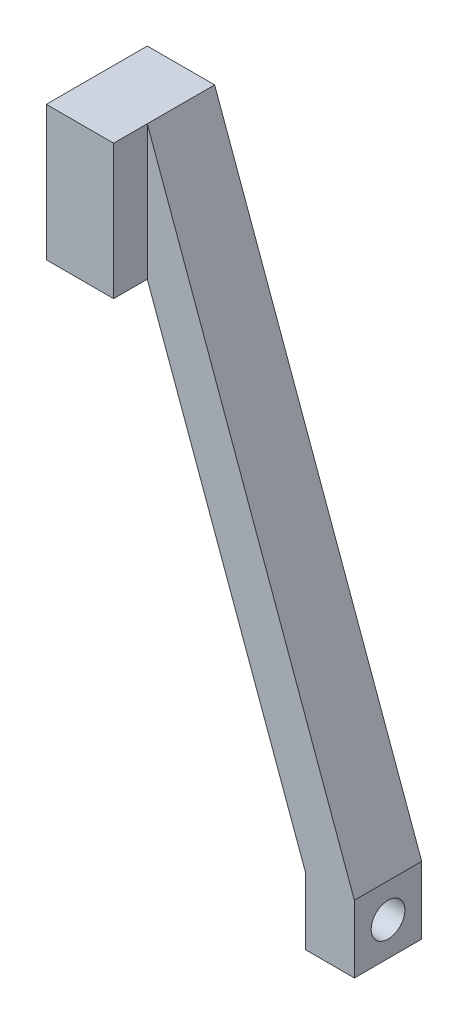
ISO-10303-21;
HEADER;
FILE_DESCRIPTION(('STEP AP214'),'2;1');
FILE_NAME('part.step','',(''),(''),'','','');
FILE_SCHEMA(('AUTOMOTIVE_DESIGN { 1 0 10303 214 1 1 1 1 }'));
ENDSEC;
DATA;
#1=APPLICATION_CONTEXT('core data for automotive mechanical design processes');
#2=APPLICATION_PROTOCOL_DEFINITION('international standard','automotive_design',2000,#1);
#3=PRODUCT_CONTEXT('',#1,'mechanical');
#4=PRODUCT('Part','Part','',(#3));
#5=PRODUCT_RELATED_PRODUCT_CATEGORY('part','',(#4));
#6=PRODUCT_DEFINITION_FORMATION('','',#4);
#7=PRODUCT_DEFINITION_CONTEXT('part definition',#1,'design');
#8=PRODUCT_DEFINITION('design','',#6,#7);
#9=PRODUCT_DEFINITION_SHAPE('','',#8);
#10=(LENGTH_UNIT() NAMED_UNIT(*) SI_UNIT(.MILLI.,.METRE.));
#11=(NAMED_UNIT(*) PLANE_ANGLE_UNIT() SI_UNIT($,.RADIAN.));
#12=(NAMED_UNIT(*) SI_UNIT($,.STERADIAN.) SOLID_ANGLE_UNIT());
#13=UNCERTAINTY_MEASURE_WITH_UNIT(LENGTH_MEASURE(1.E-05),#10,'distance_accuracy_value','');
#14=(GEOMETRIC_REPRESENTATION_CONTEXT(3) GLOBAL_UNCERTAINTY_ASSIGNED_CONTEXT((#13)) GLOBAL_UNIT_ASSIGNED_CONTEXT((#10,
#11,#12)) REPRESENTATION_CONTEXT('',''));
#15=CARTESIAN_POINT('',(0.,0.,0.));
#16=DIRECTION('',(0.,0.,1.));
#17=DIRECTION('',(1.,0.,0.));
#18=AXIS2_PLACEMENT_3D('',#15,#16,#17);
#19=CARTESIAN_POINT('',(0.,0.,-12.7));
#20=DIRECTION('',(0.,-1.,0.));
#21=DIRECTION('',(0.,0.,-1.));
#22=AXIS2_PLACEMENT_3D('',#19,#20,#21);
#23=PLANE('',#22);
#24=DIRECTION('',(1.,0.,0.));
#25=VECTOR('',#24,1.);
#26=CARTESIAN_POINT('',(0.,0.,0.));
#27=LINE('',#26,#25);
#28=CARTESIAN_POINT('',(0.,0.,0.));
#29=VERTEX_POINT('',#28);
#30=CARTESIAN_POINT('',(12.7,0.,0.));
#31=VERTEX_POINT('',#30);
#32=EDGE_CURVE('E191',#29,#31,#27,.T.);
#33=ORIENTED_EDGE('',*,*,#32,.T.);
#34=DIRECTION('',(0.,0.,1.));
#35=VECTOR('',#34,1.);
#36=CARTESIAN_POINT('',(12.7,0.,-12.7));
#37=LINE('',#36,#35);
#38=CARTESIAN_POINT('',(12.7,0.,12.7));
#39=VERTEX_POINT('',#38);
#40=EDGE_CURVE('E35',#31,#39,#37,.T.);
#41=ORIENTED_EDGE('',*,*,#40,.T.);
#42=DIRECTION('',(0.,0.,-1.));
#43=VECTOR('',#42,1.);
#44=CARTESIAN_POINT('',(12.7,0.,19.05));
#45=LINE('',#44,#43);
#46=CARTESIAN_POINT('',(12.7,0.,19.05));
#47=VERTEX_POINT('',#46);
#48=EDGE_CURVE('E160',#47,#39,#45,.T.);
#49=ORIENTED_EDGE('',*,*,#48,.F.);
#50=DIRECTION('',(1.,0.,0.));
#51=VECTOR('',#50,1.);
#52=CARTESIAN_POINT('',(0.,0.,19.05));
#53=LINE('',#52,#51);
#54=CARTESIAN_POINT('',(0.,0.,19.05));
#55=VERTEX_POINT('',#54);
#56=EDGE_CURVE('E174',#55,#47,#53,.T.);
#57=ORIENTED_EDGE('',*,*,#56,.F.);
#58=DIRECTION('',(0.,0.,1.));
#59=VECTOR('',#58,1.);
#60=CARTESIAN_POINT('',(0.,0.,-12.7));
#61=LINE('',#60,#59);
#62=EDGE_CURVE('E12',#29,#55,#61,.T.);
#63=ORIENTED_EDGE('',*,*,#62,.F.);
#64=EDGE_LOOP('',(#33,#41,#49,#57,#63));
#65=FACE_BOUND('',#64,.T.);
#66=CARTESIAN_POINT('',(6.35,0.,12.7));
#67=DIRECTION('',(0.,1.,0.));
#68=DIRECTION('',(0.,0.,1.));
#69=AXIS2_PLACEMENT_3D('',#66,#67,#68);
#70=CIRCLE('',#69,3.175);
#71=CARTESIAN_POINT('',(6.35,0.,15.875));
#72=VERTEX_POINT('',#71);
#73=EDGE_CURVE('E178',#72,#72,#70,.T.);
#74=ORIENTED_EDGE('',*,*,#73,.T.);
#75=EDGE_LOOP('',(#74));
#76=FACE_BOUND('',#75,.T.);
#77=ADVANCED_FACE('F32',(#65,#76),#23,.T.);
#78=CARTESIAN_POINT('',(51.7540061367641,-94.6,-12.7));
#79=DIRECTION('',(1.,0.,0.));
#80=DIRECTION('',(0.,0.,-1.));
#81=AXIS2_PLACEMENT_3D('',#78,#79,#80);
#82=PLANE('',#81);
#83=DIRECTION('',(0.,1.,0.));
#84=VECTOR('',#83,1.);
#85=CARTESIAN_POINT('',(51.7540061367641,-94.6,0.));
#86=LINE('',#85,#84);
#87=CARTESIAN_POINT('',(51.7540061367641,-94.6,0.));
#88=VERTEX_POINT('',#87);
#89=CARTESIAN_POINT('',(51.7540061367641,-81.9,0.));
#90=VERTEX_POINT('',#89);
#91=EDGE_CURVE('E181',#88,#90,#86,.T.);
#92=ORIENTED_EDGE('',*,*,#91,.T.);
#93=DIRECTION('',(0.,0.,1.));
#94=VECTOR('',#93,1.);
#95=CARTESIAN_POINT('',(51.7540061367641,-81.9,-12.7));
#96=LINE('',#95,#94);
#97=CARTESIAN_POINT('',(51.7540061367641,-81.9,12.7));
#98=VERTEX_POINT('',#97);
#99=EDGE_CURVE('E119',#90,#98,#96,.T.);
#100=ORIENTED_EDGE('',*,*,#99,.T.);
#101=DIRECTION('',(0.,1.,0.));
#102=VECTOR('',#101,1.);
#103=CARTESIAN_POINT('',(51.7540061367641,-94.6,12.7));
#104=LINE('',#103,#102);
#105=CARTESIAN_POINT('',(51.7540061367641,-94.6,12.7));
#106=VERTEX_POINT('',#105);
#107=EDGE_CURVE('E149',#106,#98,#104,.T.);
#108=ORIENTED_EDGE('',*,*,#107,.F.);
#109=DIRECTION('',(0.,0.,1.));
#110=VECTOR('',#109,1.);
#111=CARTESIAN_POINT('',(51.7540061367641,-94.6,-12.7));
#112=LINE('',#111,#110);
#113=EDGE_CURVE('E128',#88,#106,#112,.T.);
#114=ORIENTED_EDGE('',*,*,#113,.F.);
#115=EDGE_LOOP('',(#92,#100,#108,#114));
#116=FACE_BOUND('',#115,.T.);
#117=CARTESIAN_POINT('',(51.7540061367641,-88.25,6.35));
#118=DIRECTION('',(1.,0.,0.));
#119=DIRECTION('',(0.,0.,-1.));
#120=AXIS2_PLACEMENT_3D('',#117,#118,#119);
#121=CIRCLE('',#120,3.175);
#122=CARTESIAN_POINT('',(51.7540061367641,-88.25,3.175));
#123=VERTEX_POINT('',#122);
#124=EDGE_CURVE('E154',#123,#123,#121,.T.);
#125=ORIENTED_EDGE('',*,*,#124,.F.);
#126=EDGE_LOOP('',(#125));
#127=FACE_BOUND('',#126,.T.);
#128=ADVANCED_FACE('F216',(#116,#127),#82,.T.);
#129=CARTESIAN_POINT('',(42.5091621864025,-81.9,-12.7));
#130=DIRECTION('',(-1.,0.,0.));
#131=DIRECTION('',(0.,0.,1.));
#132=AXIS2_PLACEMENT_3D('',#129,#130,#131);
#133=PLANE('',#132);
#134=DIRECTION('',(0.,-1.,0.));
#135=VECTOR('',#134,1.);
#136=CARTESIAN_POINT('',(42.5091621864025,-81.9,0.));
#137=LINE('',#136,#135);
#138=CARTESIAN_POINT('',(42.5091621864025,-81.9,0.));
#139=VERTEX_POINT('',#138);
#140=CARTESIAN_POINT('',(42.5091621864025,-94.6,0.));
#141=VERTEX_POINT('',#140);
#142=EDGE_CURVE('E48',#139,#141,#137,.T.);
#143=ORIENTED_EDGE('',*,*,#142,.T.);
#144=DIRECTION('',(0.,0.,1.));
#145=VECTOR('',#144,1.);
#146=CARTESIAN_POINT('',(42.5091621864025,-94.6,-12.7));
#147=LINE('',#146,#145);
#148=CARTESIAN_POINT('',(42.5091621864025,-94.6,12.7));
#149=VERTEX_POINT('',#148);
#150=EDGE_CURVE('E132',#141,#149,#147,.T.);
#151=ORIENTED_EDGE('',*,*,#150,.T.);
#152=DIRECTION('',(0.,-1.,0.));
#153=VECTOR('',#152,1.);
#154=CARTESIAN_POINT('',(42.5091621864025,-81.9,12.7));
#155=LINE('',#154,#153);
#156=CARTESIAN_POINT('',(42.5091621864025,-81.9,12.7));
#157=VERTEX_POINT('',#156);
#158=EDGE_CURVE('E139',#157,#149,#155,.T.);
#159=ORIENTED_EDGE('',*,*,#158,.F.);
#160=DIRECTION('',(0.,0.,1.));
#161=VECTOR('',#160,1.);
#162=CARTESIAN_POINT('',(42.5091621864025,-81.9,-12.7));
#163=LINE('',#162,#161);
#164=EDGE_CURVE('E133',#139,#157,#163,.T.);
#165=ORIENTED_EDGE('',*,*,#164,.F.);
#166=EDGE_LOOP('',(#143,#151,#159,#165));
#167=FACE_BOUND('',#166,.T.);
#168=CARTESIAN_POINT('',(42.5091621864025,-88.25,6.35));
#169=DIRECTION('',(1.,0.,0.));
#170=DIRECTION('',(0.,0.,-1.));
#171=AXIS2_PLACEMENT_3D('',#168,#169,#170);
#172=CIRCLE('',#171,3.175);
#173=CARTESIAN_POINT('',(42.5091621864025,-88.25,3.175));
#174=VERTEX_POINT('',#173);
#175=EDGE_CURVE('E155',#174,#174,#172,.T.);
#176=ORIENTED_EDGE('',*,*,#175,.T.);
#177=EDGE_LOOP('',(#176));
#178=FACE_BOUND('',#177,.T.);
#179=ADVANCED_FACE('F207',(#167,#178),#133,.T.);
#180=CARTESIAN_POINT('',(0.,0.,-12.7));
#181=DIRECTION('',(-1.,0.,0.));
#182=DIRECTION('',(0.,0.,1.));
#183=AXIS2_PLACEMENT_3D('',#180,#181,#182);
#184=PLANE('',#183);
#185=DIRECTION('',(0.,-1.,0.));
#186=VECTOR('',#185,1.);
#187=CARTESIAN_POINT('',(0.,25.4,0.));
#188=LINE('',#187,#186);
#189=CARTESIAN_POINT('',(0.,25.4,0.));
#190=VERTEX_POINT('',#189);
#191=EDGE_CURVE('E108',#190,#29,#188,.T.);
#192=ORIENTED_EDGE('',*,*,#191,.T.);
#193=ORIENTED_EDGE('',*,*,#62,.T.);
#194=DIRECTION('',(0.,-1.,0.));
#195=VECTOR('',#194,1.);
#196=CARTESIAN_POINT('',(0.,25.4,19.05));
#197=LINE('',#196,#195);
#198=CARTESIAN_POINT('',(0.,25.4,19.05));
#199=VERTEX_POINT('',#198);
#200=EDGE_CURVE('E171',#199,#55,#197,.T.);
#201=ORIENTED_EDGE('',*,*,#200,.F.);
#202=DIRECTION('',(0.,0.,1.));
#203=VECTOR('',#202,1.);
#204=CARTESIAN_POINT('',(0.,25.4,-12.7));
#205=LINE('',#204,#203);
#206=EDGE_CURVE('E40',#190,#199,#205,.T.);
#207=ORIENTED_EDGE('',*,*,#206,.F.);
#208=EDGE_LOOP('',(#192,#193,#201,#207));
#209=FACE_BOUND('',#208,.T.);
#210=ADVANCED_FACE('F195',(#209),#184,.T.);
#211=CARTESIAN_POINT('',(0.,25.4,-12.7));
#212=DIRECTION('',(0.,1.,0.));
#213=DIRECTION('',(0.,0.,1.));
#214=AXIS2_PLACEMENT_3D('',#211,#212,#213);
#215=PLANE('',#214);
#216=DIRECTION('',(-1.,0.,0.));
#217=VECTOR('',#216,1.);
#218=CARTESIAN_POINT('',(12.7,25.4,0.));
#219=LINE('',#218,#217);
#220=CARTESIAN_POINT('',(12.7,25.4,0.));
#221=VERTEX_POINT('',#220);
#222=EDGE_CURVE('E102',#221,#190,#219,.T.);
#223=ORIENTED_EDGE('',*,*,#222,.T.);
#224=ORIENTED_EDGE('',*,*,#206,.T.);
#225=DIRECTION('',(-1.,0.,0.));
#226=VECTOR('',#225,1.);
#227=CARTESIAN_POINT('',(12.7,25.4,19.05));
#228=LINE('',#227,#226);
#229=CARTESIAN_POINT('',(12.7,25.4,19.05));
#230=VERTEX_POINT('',#229);
#231=EDGE_CURVE('E163',#230,#199,#228,.T.);
#232=ORIENTED_EDGE('',*,*,#231,.F.);
#233=DIRECTION('',(0.,0.,-1.));
#234=VECTOR('',#233,1.);
#235=CARTESIAN_POINT('',(12.7,25.4,19.05));
#236=LINE('',#235,#234);
#237=CARTESIAN_POINT('',(12.7,25.4,12.7));
#238=VERTEX_POINT('',#237);
#239=EDGE_CURVE('E124',#230,#238,#236,.T.);
#240=ORIENTED_EDGE('',*,*,#239,.T.);
#241=DIRECTION('',(0.,0.,1.));
#242=VECTOR('',#241,1.);
#243=CARTESIAN_POINT('',(12.7,25.4,-12.7));
#244=LINE('',#243,#242);
#245=EDGE_CURVE('E117',#221,#238,#244,.T.);
#246=ORIENTED_EDGE('',*,*,#245,.F.);
#247=EDGE_LOOP('',(#223,#224,#232,#240,#246));
#248=FACE_BOUND('',#247,.T.);
#249=ADVANCED_FACE('F122',(#248),#215,.T.);
#250=CARTESIAN_POINT('',(51.7540061367641,-81.9,-12.7));
#251=DIRECTION('',(0.939692620785907,0.342020143325674,0.));
#252=DIRECTION('',(-0.342020143325674,0.939692620785907,0.));
#253=AXIS2_PLACEMENT_3D('',#250,#251,#252);
#254=PLANE('',#253);
#255=DIRECTION('',(-0.342020143325674,0.939692620785907,0.));
#256=VECTOR('',#255,1.);
#257=CARTESIAN_POINT('',(51.7540061367641,-81.9,0.));
#258=LINE('',#257,#256);
#259=EDGE_CURVE('E105',#90,#221,#258,.T.);
#260=ORIENTED_EDGE('',*,*,#259,.T.);
#261=ORIENTED_EDGE('',*,*,#245,.T.);
#262=DIRECTION('',(-0.342020143325674,0.939692620785907,0.));
#263=VECTOR('',#262,1.);
#264=CARTESIAN_POINT('',(51.7540061367641,-81.9,12.7));
#265=LINE('',#264,#263);
#266=EDGE_CURVE('E152',#98,#238,#265,.T.);
#267=ORIENTED_EDGE('',*,*,#266,.F.);
#268=ORIENTED_EDGE('',*,*,#99,.F.);
#269=EDGE_LOOP('',(#260,#261,#267,#268));
#270=FACE_BOUND('',#269,.T.);
#271=ADVANCED_FACE('F115',(#270),#254,.T.);
#272=CARTESIAN_POINT('',(42.5091621864025,-94.6,-12.7));
#273=DIRECTION('',(0.,-1.,0.));
#274=DIRECTION('',(0.,0.,-1.));
#275=AXIS2_PLACEMENT_3D('',#272,#273,#274);
#276=PLANE('',#275);
#277=DIRECTION('',(1.,0.,0.));
#278=VECTOR('',#277,1.);
#279=CARTESIAN_POINT('',(42.5091621864025,-94.6,0.));
#280=LINE('',#279,#278);
#281=EDGE_CURVE('E185',#141,#88,#280,.T.);
#282=ORIENTED_EDGE('',*,*,#281,.T.);
#283=ORIENTED_EDGE('',*,*,#113,.T.);
#284=DIRECTION('',(1.,0.,0.));
#285=VECTOR('',#284,1.);
#286=CARTESIAN_POINT('',(42.5091621864025,-94.6,12.7));
#287=LINE('',#286,#285);
#288=EDGE_CURVE('E144',#149,#106,#287,.T.);
#289=ORIENTED_EDGE('',*,*,#288,.F.);
#290=ORIENTED_EDGE('',*,*,#150,.F.);
#291=EDGE_LOOP('',(#282,#283,#289,#290));
#292=FACE_BOUND('',#291,.T.);
#293=ADVANCED_FACE('F213',(#292),#276,.T.);
#294=CARTESIAN_POINT('',(12.7,0.,-12.7));
#295=DIRECTION('',(-0.939692620785906,-0.342020143325674,0.));
#296=DIRECTION('',(0.342020143325674,-0.939692620785907,0.));
#297=AXIS2_PLACEMENT_3D('',#294,#295,#296);
#298=PLANE('',#297);
#299=DIRECTION('',(0.342020143325674,-0.939692620785907,0.));
#300=VECTOR('',#299,1.);
#301=CARTESIAN_POINT('',(12.7,0.,0.));
#302=LINE('',#301,#300);
#303=EDGE_CURVE('E189',#31,#139,#302,.T.);
#304=ORIENTED_EDGE('',*,*,#303,.T.);
#305=ORIENTED_EDGE('',*,*,#164,.T.);
#306=DIRECTION('',(0.342020143325674,-0.939692620785907,0.));
#307=VECTOR('',#306,1.);
#308=CARTESIAN_POINT('',(12.7,0.,12.7));
#309=LINE('',#308,#307);
#310=EDGE_CURVE('E138',#39,#157,#309,.T.);
#311=ORIENTED_EDGE('',*,*,#310,.F.);
#312=ORIENTED_EDGE('',*,*,#40,.F.);
#313=EDGE_LOOP('',(#304,#305,#311,#312));
#314=FACE_BOUND('',#313,.T.);
#315=ADVANCED_FACE('F205',(#314),#298,.T.);
#316=CARTESIAN_POINT('',(42.5091621864025,0.,12.7));
#317=DIRECTION('',(0.,0.,1.));
#318=DIRECTION('',(-1.,0.,0.));
#319=AXIS2_PLACEMENT_3D('',#316,#317,#318);
#320=PLANE('',#319);
#321=DIRECTION('',(0.,1.,0.));
#322=VECTOR('',#321,1.);
#323=CARTESIAN_POINT('',(12.7,0.,12.7));
#324=LINE('',#323,#322);
#325=EDGE_CURVE('E165',#39,#238,#324,.T.);
#326=ORIENTED_EDGE('',*,*,#325,.F.);
#327=ORIENTED_EDGE('',*,*,#310,.T.);
#328=ORIENTED_EDGE('',*,*,#158,.T.);
#329=ORIENTED_EDGE('',*,*,#288,.T.);
#330=ORIENTED_EDGE('',*,*,#107,.T.);
#331=ORIENTED_EDGE('',*,*,#266,.T.);
#332=EDGE_LOOP('',(#326,#327,#328,#329,#330,#331));
#333=FACE_BOUND('',#332,.T.);
#334=ADVANCED_FACE('F204',(#333),#320,.T.);
#335=CARTESIAN_POINT('',(51.7540061367641,-88.25,6.35));
#336=DIRECTION('',(-1.,0.,0.));
#337=DIRECTION('',(0.,0.,1.));
#338=AXIS2_PLACEMENT_3D('',#335,#336,#337);
#339=CYLINDRICAL_SURFACE('',#338,3.175);
#340=ORIENTED_EDGE('',*,*,#124,.T.);
#341=EDGE_LOOP('',(#340));
#342=FACE_BOUND('',#341,.T.);
#343=ORIENTED_EDGE('',*,*,#175,.F.);
#344=EDGE_LOOP('',(#343));
#345=FACE_BOUND('',#344,.T.);
#346=ADVANCED_FACE('F222',(#342,#345),#339,.F.);
#347=CARTESIAN_POINT('',(12.7,0.,19.05));
#348=DIRECTION('',(-1.,0.,0.));
#349=DIRECTION('',(0.,-1.,0.));
#350=AXIS2_PLACEMENT_3D('',#347,#348,#349);
#351=PLANE('',#350);
#352=ORIENTED_EDGE('',*,*,#325,.T.);
#353=ORIENTED_EDGE('',*,*,#239,.F.);
#354=DIRECTION('',(0.,1.,0.));
#355=VECTOR('',#354,1.);
#356=CARTESIAN_POINT('',(12.7,0.,19.05));
#357=LINE('',#356,#355);
#358=EDGE_CURVE('E167',#47,#230,#357,.T.);
#359=ORIENTED_EDGE('',*,*,#358,.F.);
#360=ORIENTED_EDGE('',*,*,#48,.T.);
#361=EDGE_LOOP('',(#352,#353,#359,#360));
#362=FACE_BOUND('',#361,.T.);
#363=ADVANCED_FACE('F203',(#362),#351,.F.);
#364=CARTESIAN_POINT('',(12.7,25.4,19.05));
#365=DIRECTION('',(0.,0.,-1.));
#366=DIRECTION('',(1.,0.,0.));
#367=AXIS2_PLACEMENT_3D('',#364,#365,#366);
#368=PLANE('',#367);
#369=ORIENTED_EDGE('',*,*,#358,.T.);
#370=ORIENTED_EDGE('',*,*,#231,.T.);
#371=ORIENTED_EDGE('',*,*,#200,.T.);
#372=ORIENTED_EDGE('',*,*,#56,.T.);
#373=EDGE_LOOP('',(#369,#370,#371,#372));
#374=FACE_BOUND('',#373,.T.);
#375=ADVANCED_FACE('F201',(#374),#368,.F.);
#376=CARTESIAN_POINT('',(6.35,19.05,12.7));
#377=DIRECTION('',(0.,-1.,0.));
#378=DIRECTION('',(0.,0.,-1.));
#379=AXIS2_PLACEMENT_3D('',#376,#377,#378);
#380=CYLINDRICAL_SURFACE('',#379,3.175);
#381=CARTESIAN_POINT('',(6.35,19.05,12.7));
#382=DIRECTION('',(0.,1.,0.));
#383=DIRECTION('',(0.,0.,1.));
#384=AXIS2_PLACEMENT_3D('',#381,#382,#383);
#385=CIRCLE('',#384,3.175);
#386=CARTESIAN_POINT('',(6.35,19.05,15.875));
#387=VERTEX_POINT('',#386);
#388=EDGE_CURVE('E168',#387,#387,#385,.T.);
#389=ORIENTED_EDGE('',*,*,#388,.T.);
#390=EDGE_LOOP('',(#389));
#391=FACE_BOUND('',#390,.T.);
#392=ORIENTED_EDGE('',*,*,#73,.F.);
#393=EDGE_LOOP('',(#392));
#394=FACE_BOUND('',#393,.T.);
#395=ADVANCED_FACE('F310',(#391,#394),#380,.F.);
#396=CARTESIAN_POINT('',(6.35,19.05,12.7));
#397=DIRECTION('',(0.,-1.,0.));
#398=DIRECTION('',(0.,0.,1.));
#399=AXIS2_PLACEMENT_3D('',#396,#397,#398);
#400=PLANE('',#399);
#401=ORIENTED_EDGE('',*,*,#388,.F.);
#402=EDGE_LOOP('',(#401));
#403=FACE_BOUND('',#402,.T.);
#404=ADVANCED_FACE('F301',(#403),#400,.T.);
#405=CARTESIAN_POINT('',(12.7,25.4,0.));
#406=DIRECTION('',(0.,0.,1.));
#407=DIRECTION('',(1.,0.,0.));
#408=AXIS2_PLACEMENT_3D('',#405,#406,#407);
#409=PLANE('',#408);
#410=ORIENTED_EDGE('',*,*,#259,.F.);
#411=ORIENTED_EDGE('',*,*,#91,.F.);
#412=ORIENTED_EDGE('',*,*,#281,.F.);
#413=ORIENTED_EDGE('',*,*,#142,.F.);
#414=ORIENTED_EDGE('',*,*,#303,.F.);
#415=ORIENTED_EDGE('',*,*,#32,.F.);
#416=ORIENTED_EDGE('',*,*,#191,.F.);
#417=ORIENTED_EDGE('',*,*,#222,.F.);
#418=EDGE_LOOP('',(#410,#411,#412,#413,#414,#415,#416,#417));
#419=FACE_BOUND('',#418,.T.);
#420=ADVANCED_FACE('F104',(#419),#409,.F.);
#421=CLOSED_SHELL('',(#77,#128,#179,#210,#249,#271,#293,#315,#334,#346,#363,#375,#395,#404,#420));
#422=MANIFOLD_SOLID_BREP('B2',#421);
#423=ADVANCED_BREP_SHAPE_REPRESENTATION('',(#18,#422),#14);
#424=SHAPE_DEFINITION_REPRESENTATION(#9,#423);
ENDSEC;
END-ISO-10303-21;
